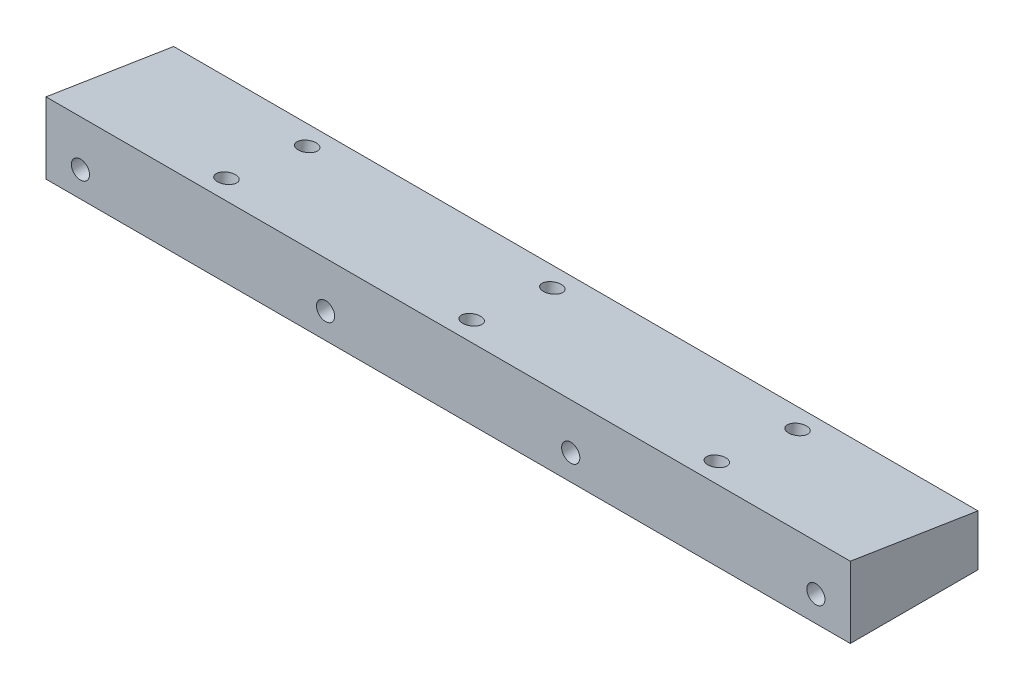
ISO-10303-21;
HEADER;
FILE_DESCRIPTION(('STEP AP214'),'2;1');
FILE_NAME('part.step','',(''),(''),'','','');
FILE_SCHEMA(('AUTOMOTIVE_DESIGN { 1 0 10303 214 1 1 1 1 }'));
ENDSEC;
DATA;
#1=APPLICATION_CONTEXT('core data for automotive mechanical design processes');
#2=APPLICATION_PROTOCOL_DEFINITION('international standard','automotive_design',2000,#1);
#3=PRODUCT_CONTEXT('',#1,'mechanical');
#4=PRODUCT('Part','Part','',(#3));
#5=PRODUCT_RELATED_PRODUCT_CATEGORY('part','',(#4));
#6=PRODUCT_DEFINITION_FORMATION('','',#4);
#7=PRODUCT_DEFINITION_CONTEXT('part definition',#1,'design');
#8=PRODUCT_DEFINITION('design','',#6,#7);
#9=PRODUCT_DEFINITION_SHAPE('','',#8);
#10=(LENGTH_UNIT() NAMED_UNIT(*) SI_UNIT(.MILLI.,.METRE.));
#11=(NAMED_UNIT(*) PLANE_ANGLE_UNIT() SI_UNIT($,.RADIAN.));
#12=(NAMED_UNIT(*) SI_UNIT($,.STERADIAN.) SOLID_ANGLE_UNIT());
#13=UNCERTAINTY_MEASURE_WITH_UNIT(LENGTH_MEASURE(1.E-05),#10,'distance_accuracy_value','');
#14=(GEOMETRIC_REPRESENTATION_CONTEXT(3) GLOBAL_UNCERTAINTY_ASSIGNED_CONTEXT((#13)) GLOBAL_UNIT_ASSIGNED_CONTEXT((#10,
#11,#12)) REPRESENTATION_CONTEXT('',''));
#15=CARTESIAN_POINT('',(0.,0.,0.));
#16=DIRECTION('',(0.,0.,1.));
#17=DIRECTION('',(1.,0.,0.));
#18=AXIS2_PLACEMENT_3D('',#15,#16,#17);
#19=CARTESIAN_POINT('',(0.,0.,15.875));
#20=DIRECTION('',(1.,0.,0.));
#21=DIRECTION('',(0.,1.,0.));
#22=AXIS2_PLACEMENT_3D('',#19,#20,#21);
#23=PLANE('',#22);
#24=DIRECTION('',(0.,-1.,0.));
#25=VECTOR('',#24,1.);
#26=CARTESIAN_POINT('',(0.,0.,0.));
#27=LINE('',#26,#25);
#28=CARTESIAN_POINT('',(0.,0.,0.));
#29=VERTEX_POINT('',#28);
#30=CARTESIAN_POINT('',(0.,-6.35,0.));
#31=VERTEX_POINT('',#30);
#32=EDGE_CURVE('E86',#29,#31,#27,.T.);
#33=ORIENTED_EDGE('',*,*,#32,.T.);
#34=DIRECTION('',(0.,0.,-1.));
#35=VECTOR('',#34,1.);
#36=CARTESIAN_POINT('',(0.,-6.35,15.875));
#37=LINE('',#36,#35);
#38=CARTESIAN_POINT('',(0.,-6.35,15.875));
#39=VERTEX_POINT('',#38);
#40=EDGE_CURVE('E13',#39,#31,#37,.T.);
#41=ORIENTED_EDGE('',*,*,#40,.F.);
#42=DIRECTION('',(0.,-1.,0.));
#43=VECTOR('',#42,1.);
#44=CARTESIAN_POINT('',(0.,0.,15.875));
#45=LINE('',#44,#43);
#46=CARTESIAN_POINT('',(0.,2.5143529901519,15.875));
#47=VERTEX_POINT('',#46);
#48=EDGE_CURVE('E106',#47,#39,#45,.T.);
#49=ORIENTED_EDGE('',*,*,#48,.F.);
#50=DIRECTION('',(0.,0.156434465040224,0.987688340595139));
#51=VECTOR('',#50,1.);
#52=CARTESIAN_POINT('',(0.,0.,0.));
#53=LINE('',#52,#51);
#54=EDGE_CURVE('E103',#29,#47,#53,.T.);
#55=ORIENTED_EDGE('',*,*,#54,.F.);
#56=EDGE_LOOP('',(#33,#41,#49,#55));
#57=FACE_BOUND('',#56,.T.);
#58=ADVANCED_FACE('F53',(#57),#23,.F.);
#59=CARTESIAN_POINT('',(0.,-6.35,15.875));
#60=DIRECTION('',(0.,1.,0.));
#61=DIRECTION('',(0.,0.,1.));
#62=AXIS2_PLACEMENT_3D('',#59,#60,#61);
#63=PLANE('',#62);
#64=CARTESIAN_POINT('',(80.48,-6.35,14.2856812306256));
#65=DIRECTION('',(0.,1.,0.));
#66=DIRECTION('',(0.,0.,-1.));
#67=AXIS2_PLACEMENT_3D('',#64,#65,#66);
#68=ELLIPSE('',#67,1.14438933167817,1.13029999999999);
#69=CARTESIAN_POINT('',(80.48,-6.35,13.1412918989474));
#70=VERTEX_POINT('',#69);
#71=EDGE_CURVE('E178',#70,#70,#68,.T.);
#72=ORIENTED_EDGE('',*,*,#71,.T.);
#73=EDGE_LOOP('',(#72));
#74=FACE_BOUND('',#73,.T.);
#75=CARTESIAN_POINT('',(80.48,-6.35,3.99903555261947));
#76=DIRECTION('',(0.,1.,0.));
#77=DIRECTION('',(0.,0.,-1.));
#78=AXIS2_PLACEMENT_3D('',#75,#76,#77);
#79=ELLIPSE('',#78,1.14438933167817,1.13029999999999);
#80=CARTESIAN_POINT('',(80.48,-6.35,2.8546462209413));
#81=VERTEX_POINT('',#80);
#82=EDGE_CURVE('E182',#81,#81,#79,.T.);
#83=ORIENTED_EDGE('',*,*,#82,.T.);
#84=EDGE_LOOP('',(#83));
#85=FACE_BOUND('',#84,.T.);
#86=CARTESIAN_POINT('',(50.,-6.35,14.2856812306256));
#87=DIRECTION('',(0.,1.,0.));
#88=DIRECTION('',(0.,0.,-1.));
#89=AXIS2_PLACEMENT_3D('',#86,#87,#88);
#90=ELLIPSE('',#89,1.14438933167817,1.13029999999999);
#91=CARTESIAN_POINT('',(50.,-6.35,13.1412918989474));
#92=VERTEX_POINT('',#91);
#93=EDGE_CURVE('E186',#92,#92,#90,.T.);
#94=ORIENTED_EDGE('',*,*,#93,.T.);
#95=EDGE_LOOP('',(#94));
#96=FACE_BOUND('',#95,.T.);
#97=CARTESIAN_POINT('',(50.,-6.35,3.99903555261948));
#98=DIRECTION('',(0.,1.,0.));
#99=DIRECTION('',(0.,0.,-1.));
#100=AXIS2_PLACEMENT_3D('',#97,#98,#99);
#101=ELLIPSE('',#100,1.14438933167817,1.13029999999999);
#102=CARTESIAN_POINT('',(50.,-6.35,2.85464622094131));
#103=VERTEX_POINT('',#102);
#104=EDGE_CURVE('E190',#103,#103,#101,.T.);
#105=ORIENTED_EDGE('',*,*,#104,.T.);
#106=EDGE_LOOP('',(#105));
#107=FACE_BOUND('',#106,.T.);
#108=CARTESIAN_POINT('',(19.52,-6.35,14.2856812306256));
#109=DIRECTION('',(0.,1.,0.));
#110=DIRECTION('',(0.,0.,-1.));
#111=AXIS2_PLACEMENT_3D('',#108,#109,#110);
#112=ELLIPSE('',#111,1.14438933167817,1.13029999999999);
#113=CARTESIAN_POINT('',(19.52,-6.35,13.1412918989474));
#114=VERTEX_POINT('',#113);
#115=EDGE_CURVE('E194',#114,#114,#112,.T.);
#116=ORIENTED_EDGE('',*,*,#115,.T.);
#117=EDGE_LOOP('',(#116));
#118=FACE_BOUND('',#117,.T.);
#119=CARTESIAN_POINT('',(19.52,-6.35,3.99903555261948));
#120=DIRECTION('',(0.,1.,0.));
#121=DIRECTION('',(0.,0.,-1.));
#122=AXIS2_PLACEMENT_3D('',#119,#120,#121);
#123=ELLIPSE('',#122,1.14438933167817,1.13029999999999);
#124=CARTESIAN_POINT('',(19.52,-6.35,2.85464622094131));
#125=VERTEX_POINT('',#124);
#126=EDGE_CURVE('E115',#125,#125,#123,.T.);
#127=ORIENTED_EDGE('',*,*,#126,.T.);
#128=EDGE_LOOP('',(#127));
#129=FACE_BOUND('',#128,.T.);
#130=DIRECTION('',(1.,0.,0.));
#131=VECTOR('',#130,1.);
#132=CARTESIAN_POINT('',(0.,-6.35,0.));
#133=LINE('',#132,#131);
#134=CARTESIAN_POINT('',(100.,-6.35,0.));
#135=VERTEX_POINT('',#134);
#136=EDGE_CURVE('E80',#31,#135,#133,.T.);
#137=ORIENTED_EDGE('',*,*,#136,.T.);
#138=DIRECTION('',(0.,0.,-1.));
#139=VECTOR('',#138,1.);
#140=CARTESIAN_POINT('',(100.,-6.35,15.875));
#141=LINE('',#140,#139);
#142=CARTESIAN_POINT('',(100.,-6.35,15.875));
#143=VERTEX_POINT('',#142);
#144=EDGE_CURVE('E61',#143,#135,#141,.T.);
#145=ORIENTED_EDGE('',*,*,#144,.F.);
#146=DIRECTION('',(1.,0.,0.));
#147=VECTOR('',#146,1.);
#148=CARTESIAN_POINT('',(0.,-6.35,15.875));
#149=LINE('',#148,#147);
#150=EDGE_CURVE('E69',#39,#143,#149,.T.);
#151=ORIENTED_EDGE('',*,*,#150,.F.);
#152=ORIENTED_EDGE('',*,*,#40,.T.);
#153=EDGE_LOOP('',(#137,#145,#151,#152));
#154=FACE_BOUND('',#153,.T.);
#155=ADVANCED_FACE('F150',(#74,#85,#96,#107,#118,#129,#154),#63,.F.);
#156=CARTESIAN_POINT('',(100.,0.,15.875));
#157=DIRECTION('',(-1.,0.,0.));
#158=DIRECTION('',(0.,0.,1.));
#159=AXIS2_PLACEMENT_3D('',#156,#157,#158);
#160=PLANE('',#159);
#161=DIRECTION('',(0.,1.,0.));
#162=VECTOR('',#161,1.);
#163=CARTESIAN_POINT('',(100.,0.,0.));
#164=LINE('',#163,#162);
#165=CARTESIAN_POINT('',(100.,0.,0.));
#166=VERTEX_POINT('',#165);
#167=EDGE_CURVE('E107',#135,#166,#164,.T.);
#168=ORIENTED_EDGE('',*,*,#167,.T.);
#169=DIRECTION('',(0.,0.156434465040224,0.987688340595139));
#170=VECTOR('',#169,1.);
#171=CARTESIAN_POINT('',(100.,0.,0.));
#172=LINE('',#171,#170);
#173=CARTESIAN_POINT('',(100.,2.5143529901519,15.875));
#174=VERTEX_POINT('',#173);
#175=EDGE_CURVE('E105',#166,#174,#172,.T.);
#176=ORIENTED_EDGE('',*,*,#175,.T.);
#177=DIRECTION('',(0.,1.,0.));
#178=VECTOR('',#177,1.);
#179=CARTESIAN_POINT('',(100.,0.,15.875));
#180=LINE('',#179,#178);
#181=EDGE_CURVE('E144',#143,#174,#180,.T.);
#182=ORIENTED_EDGE('',*,*,#181,.F.);
#183=ORIENTED_EDGE('',*,*,#144,.T.);
#184=EDGE_LOOP('',(#168,#176,#182,#183));
#185=FACE_BOUND('',#184,.T.);
#186=ADVANCED_FACE('F149',(#185),#160,.F.);
#187=CARTESIAN_POINT('',(0.,0.,15.875));
#188=DIRECTION('',(0.,0.,1.));
#189=DIRECTION('',(1.,0.,0.));
#190=AXIS2_PLACEMENT_3D('',#187,#188,#189);
#191=PLANE('',#190);
#192=CARTESIAN_POINT('',(95.72,-3.175,15.875));
#193=DIRECTION('',(0.,0.,-1.));
#194=DIRECTION('',(-1.,0.,0.));
#195=AXIS2_PLACEMENT_3D('',#192,#193,#194);
#196=CIRCLE('',#195,1.1303);
#197=CARTESIAN_POINT('',(94.5897,-3.175,15.875));
#198=VERTEX_POINT('',#197);
#199=EDGE_CURVE('E122',#198,#198,#196,.T.);
#200=ORIENTED_EDGE('',*,*,#199,.T.);
#201=EDGE_LOOP('',(#200));
#202=FACE_BOUND('',#201,.T.);
#203=CARTESIAN_POINT('',(4.28000000000001,-3.175,15.875));
#204=DIRECTION('',(0.,0.,-1.));
#205=DIRECTION('',(-1.,0.,0.));
#206=AXIS2_PLACEMENT_3D('',#203,#204,#205);
#207=CIRCLE('',#206,1.1303);
#208=CARTESIAN_POINT('',(3.14970000000001,-3.175,15.875));
#209=VERTEX_POINT('',#208);
#210=EDGE_CURVE('E128',#209,#209,#207,.T.);
#211=ORIENTED_EDGE('',*,*,#210,.T.);
#212=EDGE_LOOP('',(#211));
#213=FACE_BOUND('',#212,.T.);
#214=CARTESIAN_POINT('',(34.76,-3.175,15.875));
#215=DIRECTION('',(0.,0.,-1.));
#216=DIRECTION('',(-1.,0.,0.));
#217=AXIS2_PLACEMENT_3D('',#214,#215,#216);
#218=CIRCLE('',#217,1.13029999999999);
#219=CARTESIAN_POINT('',(33.6297,-3.175,15.875));
#220=VERTEX_POINT('',#219);
#221=EDGE_CURVE('E134',#220,#220,#218,.T.);
#222=ORIENTED_EDGE('',*,*,#221,.T.);
#223=EDGE_LOOP('',(#222));
#224=FACE_BOUND('',#223,.T.);
#225=CARTESIAN_POINT('',(65.24,-3.175,15.875));
#226=DIRECTION('',(0.,0.,-1.));
#227=DIRECTION('',(-1.,0.,0.));
#228=AXIS2_PLACEMENT_3D('',#225,#226,#227);
#229=CIRCLE('',#228,1.1303);
#230=CARTESIAN_POINT('',(64.1097,-3.175,15.875));
#231=VERTEX_POINT('',#230);
#232=EDGE_CURVE('E96',#231,#231,#229,.T.);
#233=ORIENTED_EDGE('',*,*,#232,.T.);
#234=EDGE_LOOP('',(#233));
#235=FACE_BOUND('',#234,.T.);
#236=ORIENTED_EDGE('',*,*,#48,.T.);
#237=ORIENTED_EDGE('',*,*,#150,.T.);
#238=ORIENTED_EDGE('',*,*,#181,.T.);
#239=DIRECTION('',(1.,0.,0.));
#240=VECTOR('',#239,1.);
#241=CARTESIAN_POINT('',(0.,2.5143529901519,15.875));
#242=LINE('',#241,#240);
#243=EDGE_CURVE('E111',#47,#174,#242,.T.);
#244=ORIENTED_EDGE('',*,*,#243,.F.);
#245=EDGE_LOOP('',(#236,#237,#238,#244));
#246=FACE_BOUND('',#245,.T.);
#247=ADVANCED_FACE('F151',(#202,#213,#224,#235,#246),#191,.T.);
#248=CARTESIAN_POINT('',(0.,0.,0.));
#249=DIRECTION('',(0.,0.,1.));
#250=DIRECTION('',(1.,0.,0.));
#251=AXIS2_PLACEMENT_3D('',#248,#249,#250);
#252=PLANE('',#251);
#253=CARTESIAN_POINT('',(95.72,-3.175,0.));
#254=DIRECTION('',(0.,0.,-1.));
#255=DIRECTION('',(-1.,0.,0.));
#256=AXIS2_PLACEMENT_3D('',#253,#254,#255);
#257=CIRCLE('',#256,1.1303);
#258=CARTESIAN_POINT('',(94.5897,-3.175,0.));
#259=VERTEX_POINT('',#258);
#260=EDGE_CURVE('E113',#259,#259,#257,.T.);
#261=ORIENTED_EDGE('',*,*,#260,.F.);
#262=EDGE_LOOP('',(#261));
#263=FACE_BOUND('',#262,.T.);
#264=CARTESIAN_POINT('',(4.28000000000001,-3.175,0.));
#265=DIRECTION('',(0.,0.,-1.));
#266=DIRECTION('',(-1.,0.,0.));
#267=AXIS2_PLACEMENT_3D('',#264,#265,#266);
#268=CIRCLE('',#267,1.1303);
#269=CARTESIAN_POINT('',(3.14970000000001,-3.175,0.));
#270=VERTEX_POINT('',#269);
#271=EDGE_CURVE('E125',#270,#270,#268,.T.);
#272=ORIENTED_EDGE('',*,*,#271,.F.);
#273=EDGE_LOOP('',(#272));
#274=FACE_BOUND('',#273,.T.);
#275=CARTESIAN_POINT('',(34.76,-3.175,0.));
#276=DIRECTION('',(0.,0.,-1.));
#277=DIRECTION('',(-1.,0.,0.));
#278=AXIS2_PLACEMENT_3D('',#275,#276,#277);
#279=CIRCLE('',#278,1.1303);
#280=CARTESIAN_POINT('',(33.6297,-3.175,0.));
#281=VERTEX_POINT('',#280);
#282=EDGE_CURVE('E131',#281,#281,#279,.T.);
#283=ORIENTED_EDGE('',*,*,#282,.F.);
#284=EDGE_LOOP('',(#283));
#285=FACE_BOUND('',#284,.T.);
#286=CARTESIAN_POINT('',(65.24,-3.175,0.));
#287=DIRECTION('',(0.,0.,-1.));
#288=DIRECTION('',(-1.,0.,0.));
#289=AXIS2_PLACEMENT_3D('',#286,#287,#288);
#290=CIRCLE('',#289,1.1303);
#291=CARTESIAN_POINT('',(64.1097,-3.175,0.));
#292=VERTEX_POINT('',#291);
#293=EDGE_CURVE('E137',#292,#292,#290,.T.);
#294=ORIENTED_EDGE('',*,*,#293,.F.);
#295=EDGE_LOOP('',(#294));
#296=FACE_BOUND('',#295,.T.);
#297=ORIENTED_EDGE('',*,*,#32,.F.);
#298=DIRECTION('',(-1.,0.,0.));
#299=VECTOR('',#298,1.);
#300=CARTESIAN_POINT('',(0.,0.,0.));
#301=LINE('',#300,#299);
#302=EDGE_CURVE('E91',#166,#29,#301,.T.);
#303=ORIENTED_EDGE('',*,*,#302,.F.);
#304=ORIENTED_EDGE('',*,*,#167,.F.);
#305=ORIENTED_EDGE('',*,*,#136,.F.);
#306=EDGE_LOOP('',(#297,#303,#304,#305));
#307=FACE_BOUND('',#306,.T.);
#308=ADVANCED_FACE('F88',(#263,#274,#285,#296,#307),#252,.F.);
#309=CARTESIAN_POINT('',(65.24,-3.175,0.));
#310=DIRECTION('',(0.,0.,-1.));
#311=DIRECTION('',(-1.,0.,0.));
#312=AXIS2_PLACEMENT_3D('',#309,#310,#311);
#313=CYLINDRICAL_SURFACE('',#312,1.1303);
#314=ORIENTED_EDGE('',*,*,#232,.F.);
#315=EDGE_LOOP('',(#314));
#316=FACE_BOUND('',#315,.T.);
#317=ORIENTED_EDGE('',*,*,#293,.T.);
#318=EDGE_LOOP('',(#317));
#319=FACE_BOUND('',#318,.T.);
#320=ADVANCED_FACE('F162',(#316,#319),#313,.F.);
#321=CARTESIAN_POINT('',(34.76,-3.175,0.));
#322=DIRECTION('',(0.,0.,-1.));
#323=DIRECTION('',(-1.,0.,0.));
#324=AXIS2_PLACEMENT_3D('',#321,#322,#323);
#325=CYLINDRICAL_SURFACE('',#324,1.1303);
#326=ORIENTED_EDGE('',*,*,#221,.F.);
#327=EDGE_LOOP('',(#326));
#328=FACE_BOUND('',#327,.T.);
#329=ORIENTED_EDGE('',*,*,#282,.T.);
#330=EDGE_LOOP('',(#329));
#331=FACE_BOUND('',#330,.T.);
#332=ADVANCED_FACE('F262',(#328,#331),#325,.F.);
#333=CARTESIAN_POINT('',(4.28000000000001,-3.175,0.));
#334=DIRECTION('',(0.,0.,-1.));
#335=DIRECTION('',(-1.,0.,0.));
#336=AXIS2_PLACEMENT_3D('',#333,#334,#335);
#337=CYLINDRICAL_SURFACE('',#336,1.1303);
#338=ORIENTED_EDGE('',*,*,#210,.F.);
#339=EDGE_LOOP('',(#338));
#340=FACE_BOUND('',#339,.T.);
#341=ORIENTED_EDGE('',*,*,#271,.T.);
#342=EDGE_LOOP('',(#341));
#343=FACE_BOUND('',#342,.T.);
#344=ADVANCED_FACE('F258',(#340,#343),#337,.F.);
#345=CARTESIAN_POINT('',(95.72,-3.175,0.));
#346=DIRECTION('',(0.,0.,-1.));
#347=DIRECTION('',(-1.,0.,0.));
#348=AXIS2_PLACEMENT_3D('',#345,#346,#347);
#349=CYLINDRICAL_SURFACE('',#348,1.1303);
#350=ORIENTED_EDGE('',*,*,#199,.F.);
#351=EDGE_LOOP('',(#350));
#352=FACE_BOUND('',#351,.T.);
#353=ORIENTED_EDGE('',*,*,#260,.T.);
#354=EDGE_LOOP('',(#353));
#355=FACE_BOUND('',#354,.T.);
#356=ADVANCED_FACE('F230',(#352,#355),#349,.F.);
#357=CARTESIAN_POINT('',(0.,0.,0.));
#358=DIRECTION('',(0.,0.987688340595139,-0.156434465040224));
#359=DIRECTION('',(0.,0.156434465040224,0.987688340595139));
#360=AXIS2_PLACEMENT_3D('',#357,#358,#359);
#361=PLANE('',#360);
#362=CARTESIAN_POINT('',(80.48,2.05186357748029,12.9549567702233));
#363=DIRECTION('',(0.,0.987688340595139,-0.156434465040224));
#364=DIRECTION('',(0.,0.156434465040224,0.987688340595139));
#365=AXIS2_PLACEMENT_3D('',#362,#363,#364);
#366=CIRCLE('',#365,1.13029999999999);
#367=CARTESIAN_POINT('',(80.48,2.22868145331526,14.071340901598));
#368=VERTEX_POINT('',#367);
#369=EDGE_CURVE('E220',#368,#368,#366,.T.);
#370=ORIENTED_EDGE('',*,*,#369,.F.);
#371=EDGE_LOOP('',(#370));
#372=FACE_BOUND('',#371,.T.);
#373=CARTESIAN_POINT('',(80.48,0.462489412671615,2.9200432297767));
#374=DIRECTION('',(0.,0.987688340595139,-0.156434465040224));
#375=DIRECTION('',(0.,0.156434465040224,0.987688340595139));
#376=AXIS2_PLACEMENT_3D('',#373,#374,#375);
#377=CIRCLE('',#376,1.13029999999999);
#378=CARTESIAN_POINT('',(80.48,0.639307288506578,4.03642736115137));
#379=VERTEX_POINT('',#378);
#380=EDGE_CURVE('E216',#379,#379,#377,.T.);
#381=ORIENTED_EDGE('',*,*,#380,.F.);
#382=EDGE_LOOP('',(#381));
#383=FACE_BOUND('',#382,.T.);
#384=CARTESIAN_POINT('',(50.,2.05186357748029,12.9549567702233));
#385=DIRECTION('',(0.,0.987688340595139,-0.156434465040224));
#386=DIRECTION('',(0.,0.156434465040224,0.987688340595139));
#387=AXIS2_PLACEMENT_3D('',#384,#385,#386);
#388=CIRCLE('',#387,1.13029999999999);
#389=CARTESIAN_POINT('',(50.,2.22868145331526,14.071340901598));
#390=VERTEX_POINT('',#389);
#391=EDGE_CURVE('E212',#390,#390,#388,.T.);
#392=ORIENTED_EDGE('',*,*,#391,.F.);
#393=EDGE_LOOP('',(#392));
#394=FACE_BOUND('',#393,.T.);
#395=CARTESIAN_POINT('',(50.,0.462489412671616,2.9200432297767));
#396=DIRECTION('',(0.,0.987688340595139,-0.156434465040224));
#397=DIRECTION('',(0.,0.156434465040224,0.987688340595139));
#398=AXIS2_PLACEMENT_3D('',#395,#396,#397);
#399=CIRCLE('',#398,1.13029999999999);
#400=CARTESIAN_POINT('',(50.,0.639307288506579,4.03642736115137));
#401=VERTEX_POINT('',#400);
#402=EDGE_CURVE('E208',#401,#401,#399,.T.);
#403=ORIENTED_EDGE('',*,*,#402,.F.);
#404=EDGE_LOOP('',(#403));
#405=FACE_BOUND('',#404,.T.);
#406=CARTESIAN_POINT('',(19.52,2.05186357748029,12.9549567702233));
#407=DIRECTION('',(0.,0.987688340595139,-0.156434465040224));
#408=DIRECTION('',(0.,0.156434465040224,0.987688340595139));
#409=AXIS2_PLACEMENT_3D('',#406,#407,#408);
#410=CIRCLE('',#409,1.13029999999999);
#411=CARTESIAN_POINT('',(19.52,2.22868145331526,14.071340901598));
#412=VERTEX_POINT('',#411);
#413=EDGE_CURVE('E202',#412,#412,#410,.T.);
#414=ORIENTED_EDGE('',*,*,#413,.F.);
#415=EDGE_LOOP('',(#414));
#416=FACE_BOUND('',#415,.T.);
#417=CARTESIAN_POINT('',(19.52,0.462489412671616,2.9200432297767));
#418=DIRECTION('',(0.,0.987688340595139,-0.156434465040224));
#419=DIRECTION('',(0.,0.156434465040224,0.987688340595139));
#420=AXIS2_PLACEMENT_3D('',#417,#418,#419);
#421=CIRCLE('',#420,1.13029999999999);
#422=CARTESIAN_POINT('',(19.52,0.639307288506579,4.03642736115137));
#423=VERTEX_POINT('',#422);
#424=EDGE_CURVE('E198',#423,#423,#421,.T.);
#425=ORIENTED_EDGE('',*,*,#424,.F.);
#426=EDGE_LOOP('',(#425));
#427=FACE_BOUND('',#426,.T.);
#428=ORIENTED_EDGE('',*,*,#175,.F.);
#429=ORIENTED_EDGE('',*,*,#302,.T.);
#430=ORIENTED_EDGE('',*,*,#54,.T.);
#431=ORIENTED_EDGE('',*,*,#243,.T.);
#432=EDGE_LOOP('',(#428,#429,#430,#431));
#433=FACE_BOUND('',#432,.T.);
#434=ADVANCED_FACE('F101',(#372,#383,#394,#405,#416,#427,#433),#361,.T.);
#435=CARTESIAN_POINT('',(19.52,0.462489412671614,2.9200432297767));
#436=DIRECTION('',(0.,0.987688340595139,-0.156434465040224));
#437=DIRECTION('',(0.,0.156434465040224,0.987688340595139));
#438=AXIS2_PLACEMENT_3D('',#435,#436,#437);
#439=CYLINDRICAL_SURFACE('',#438,1.13029999999999);
#440=ORIENTED_EDGE('',*,*,#424,.T.);
#441=EDGE_LOOP('',(#440));
#442=FACE_BOUND('',#441,.T.);
#443=ORIENTED_EDGE('',*,*,#126,.F.);
#444=EDGE_LOOP('',(#443));
#445=FACE_BOUND('',#444,.T.);
#446=ADVANCED_FACE('F229',(#442,#445),#439,.F.);
#447=CARTESIAN_POINT('',(19.52,2.05186357748029,12.9549567702233));
#448=DIRECTION('',(0.,0.987688340595139,-0.156434465040224));
#449=DIRECTION('',(0.,0.156434465040224,0.987688340595139));
#450=AXIS2_PLACEMENT_3D('',#447,#448,#449);
#451=CYLINDRICAL_SURFACE('',#450,1.13029999999999);
#452=ORIENTED_EDGE('',*,*,#413,.T.);
#453=EDGE_LOOP('',(#452));
#454=FACE_BOUND('',#453,.T.);
#455=ORIENTED_EDGE('',*,*,#115,.F.);
#456=EDGE_LOOP('',(#455));
#457=FACE_BOUND('',#456,.T.);
#458=ADVANCED_FACE('F241',(#454,#457),#451,.F.);
#459=CARTESIAN_POINT('',(50.,0.462489412671614,2.9200432297767));
#460=DIRECTION('',(0.,0.987688340595139,-0.156434465040224));
#461=DIRECTION('',(0.,0.156434465040224,0.987688340595139));
#462=AXIS2_PLACEMENT_3D('',#459,#460,#461);
#463=CYLINDRICAL_SURFACE('',#462,1.13029999999999);
#464=ORIENTED_EDGE('',*,*,#402,.T.);
#465=EDGE_LOOP('',(#464));
#466=FACE_BOUND('',#465,.T.);
#467=ORIENTED_EDGE('',*,*,#104,.F.);
#468=EDGE_LOOP('',(#467));
#469=FACE_BOUND('',#468,.T.);
#470=ADVANCED_FACE('F244',(#466,#469),#463,.F.);
#471=CARTESIAN_POINT('',(50.,2.05186357748029,12.9549567702233));
#472=DIRECTION('',(0.,0.987688340595139,-0.156434465040224));
#473=DIRECTION('',(0.,0.156434465040224,0.987688340595139));
#474=AXIS2_PLACEMENT_3D('',#471,#472,#473);
#475=CYLINDRICAL_SURFACE('',#474,1.13029999999999);
#476=ORIENTED_EDGE('',*,*,#391,.T.);
#477=EDGE_LOOP('',(#476));
#478=FACE_BOUND('',#477,.T.);
#479=ORIENTED_EDGE('',*,*,#93,.F.);
#480=EDGE_LOOP('',(#479));
#481=FACE_BOUND('',#480,.T.);
#482=ADVANCED_FACE('F250',(#478,#481),#475,.F.);
#483=CARTESIAN_POINT('',(80.48,0.462489412671614,2.9200432297767));
#484=DIRECTION('',(0.,0.987688340595139,-0.156434465040224));
#485=DIRECTION('',(0.,0.156434465040224,0.987688340595139));
#486=AXIS2_PLACEMENT_3D('',#483,#484,#485);
#487=CYLINDRICAL_SURFACE('',#486,1.13029999999999);
#488=ORIENTED_EDGE('',*,*,#380,.T.);
#489=EDGE_LOOP('',(#488));
#490=FACE_BOUND('',#489,.T.);
#491=ORIENTED_EDGE('',*,*,#82,.F.);
#492=EDGE_LOOP('',(#491));
#493=FACE_BOUND('',#492,.T.);
#494=ADVANCED_FACE('F331',(#490,#493),#487,.F.);
#495=CARTESIAN_POINT('',(80.48,2.05186357748029,12.9549567702233));
#496=DIRECTION('',(0.,0.987688340595139,-0.156434465040224));
#497=DIRECTION('',(0.,0.156434465040224,0.987688340595139));
#498=AXIS2_PLACEMENT_3D('',#495,#496,#497);
#499=CYLINDRICAL_SURFACE('',#498,1.13029999999999);
#500=ORIENTED_EDGE('',*,*,#369,.T.);
#501=EDGE_LOOP('',(#500));
#502=FACE_BOUND('',#501,.T.);
#503=ORIENTED_EDGE('',*,*,#71,.F.);
#504=EDGE_LOOP('',(#503));
#505=FACE_BOUND('',#504,.T.);
#506=ADVANCED_FACE('F224',(#502,#505),#499,.F.);
#507=CLOSED_SHELL('',(#58,#155,#186,#247,#308,#320,#332,#344,#356,#434,#446,#458,#470,#482,#494,#506));
#508=MANIFOLD_SOLID_BREP('B2',#507);
#509=ADVANCED_BREP_SHAPE_REPRESENTATION('',(#18,#508),#14);
#510=SHAPE_DEFINITION_REPRESENTATION(#9,#509);
ENDSEC;
END-ISO-10303-21;
